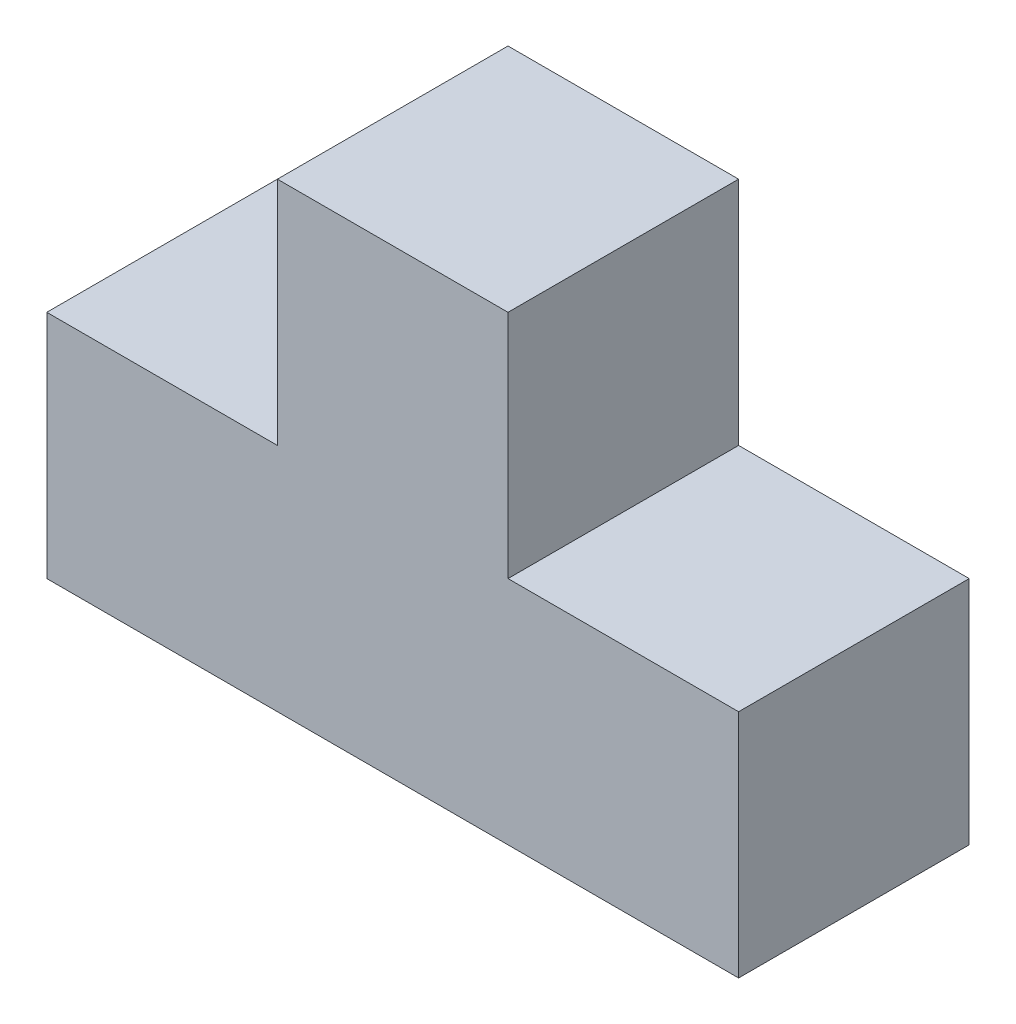
ISO-10303-21;
HEADER;
FILE_DESCRIPTION(('STEP AP214'),'2;1');
FILE_NAME('part.step','',(''),(''),'','','');
FILE_SCHEMA(('AUTOMOTIVE_DESIGN { 1 0 10303 214 1 1 1 1 }'));
ENDSEC;
DATA;
#1=APPLICATION_CONTEXT('core data for automotive mechanical design processes');
#2=APPLICATION_PROTOCOL_DEFINITION('international standard','automotive_design',2000,#1);
#3=PRODUCT_CONTEXT('',#1,'mechanical');
#4=PRODUCT('Part','Part','',(#3));
#5=PRODUCT_RELATED_PRODUCT_CATEGORY('part','',(#4));
#6=PRODUCT_DEFINITION_FORMATION('','',#4);
#7=PRODUCT_DEFINITION_CONTEXT('part definition',#1,'design');
#8=PRODUCT_DEFINITION('design','',#6,#7);
#9=PRODUCT_DEFINITION_SHAPE('','',#8);
#10=(LENGTH_UNIT() NAMED_UNIT(*) SI_UNIT(.MILLI.,.METRE.));
#11=(NAMED_UNIT(*) PLANE_ANGLE_UNIT() SI_UNIT($,.RADIAN.));
#12=(NAMED_UNIT(*) SI_UNIT($,.STERADIAN.) SOLID_ANGLE_UNIT());
#13=UNCERTAINTY_MEASURE_WITH_UNIT(LENGTH_MEASURE(1.E-05),#10,'distance_accuracy_value','');
#14=(GEOMETRIC_REPRESENTATION_CONTEXT(3) GLOBAL_UNCERTAINTY_ASSIGNED_CONTEXT((#13)) GLOBAL_UNIT_ASSIGNED_CONTEXT((#10,
#11,#12)) REPRESENTATION_CONTEXT('',''));
#15=CARTESIAN_POINT('',(0.,0.,0.));
#16=DIRECTION('',(0.,0.,1.));
#17=DIRECTION('',(1.,0.,0.));
#18=AXIS2_PLACEMENT_3D('',#15,#16,#17);
#19=CARTESIAN_POINT('',(-50.7256947830327,17.8332520721599,10.));
#20=DIRECTION('',(0.,-1.,0.));
#21=DIRECTION('',(0.,0.,-1.));
#22=AXIS2_PLACEMENT_3D('',#19,#20,#21);
#23=PLANE('',#22);
#24=DIRECTION('',(-1.,0.,0.));
#25=VECTOR('',#24,1.);
#26=CARTESIAN_POINT('',(-50.7256947830327,17.8332520721599,0.));
#27=LINE('',#26,#25);
#28=CARTESIAN_POINT('',(-40.7256947830327,17.8332520721599,0.));
#29=VERTEX_POINT('',#28);
#30=CARTESIAN_POINT('',(-50.7256947830327,17.8332520721599,0.));
#31=VERTEX_POINT('',#30);
#32=EDGE_CURVE('E144',#29,#31,#27,.T.);
#33=ORIENTED_EDGE('',*,*,#32,.T.);
#34=DIRECTION('',(0.,0.,-1.));
#35=VECTOR('',#34,1.);
#36=CARTESIAN_POINT('',(-50.7256947830327,17.8332520721599,10.));
#37=LINE('',#36,#35);
#38=CARTESIAN_POINT('',(-50.7256947830327,17.8332520721599,10.));
#39=VERTEX_POINT('',#38);
#40=EDGE_CURVE('E11',#39,#31,#37,.T.);
#41=ORIENTED_EDGE('',*,*,#40,.F.);
#42=DIRECTION('',(-1.,0.,0.));
#43=VECTOR('',#42,1.);
#44=CARTESIAN_POINT('',(-50.7256947830327,17.8332520721599,10.));
#45=LINE('',#44,#43);
#46=CARTESIAN_POINT('',(-40.7256947830327,17.8332520721599,10.));
#47=VERTEX_POINT('',#46);
#48=EDGE_CURVE('E167',#47,#39,#45,.T.);
#49=ORIENTED_EDGE('',*,*,#48,.F.);
#50=DIRECTION('',(0.,0.,-1.));
#51=VECTOR('',#50,1.);
#52=CARTESIAN_POINT('',(-40.7256947830327,17.8332520721599,10.));
#53=LINE('',#52,#51);
#54=EDGE_CURVE('E140',#47,#29,#53,.T.);
#55=ORIENTED_EDGE('',*,*,#54,.T.);
#56=EDGE_LOOP('',(#33,#41,#49,#55));
#57=FACE_BOUND('',#56,.T.);
#58=ADVANCED_FACE('F43',(#57),#23,.F.);
#59=CARTESIAN_POINT('',(-50.7256947830327,17.8332520721599,10.));
#60=DIRECTION('',(1.,0.,0.));
#61=DIRECTION('',(0.,0.,-1.));
#62=AXIS2_PLACEMENT_3D('',#59,#60,#61);
#63=PLANE('',#62);
#64=DIRECTION('',(0.,-1.,0.));
#65=VECTOR('',#64,1.);
#66=CARTESIAN_POINT('',(-50.7256947830327,17.8332520721599,0.));
#67=LINE('',#66,#65);
#68=CARTESIAN_POINT('',(-50.7256947830327,7.83325207215992,0.));
#69=VERTEX_POINT('',#68);
#70=EDGE_CURVE('E148',#31,#69,#67,.T.);
#71=ORIENTED_EDGE('',*,*,#70,.T.);
#72=DIRECTION('',(0.,0.,-1.));
#73=VECTOR('',#72,1.);
#74=CARTESIAN_POINT('',(-50.7256947830327,7.83325207215992,10.));
#75=LINE('',#74,#73);
#76=CARTESIAN_POINT('',(-50.7256947830327,7.83325207215992,10.));
#77=VERTEX_POINT('',#76);
#78=EDGE_CURVE('E52',#77,#69,#75,.T.);
#79=ORIENTED_EDGE('',*,*,#78,.F.);
#80=DIRECTION('',(0.,-1.,0.));
#81=VECTOR('',#80,1.);
#82=CARTESIAN_POINT('',(-50.7256947830327,17.8332520721599,10.));
#83=LINE('',#82,#81);
#84=EDGE_CURVE('E103',#39,#77,#83,.T.);
#85=ORIENTED_EDGE('',*,*,#84,.F.);
#86=ORIENTED_EDGE('',*,*,#40,.T.);
#87=EDGE_LOOP('',(#71,#79,#85,#86));
#88=FACE_BOUND('',#87,.T.);
#89=ADVANCED_FACE('F188',(#88),#63,.F.);
#90=CARTESIAN_POINT('',(-20.7256947830327,7.83325207215992,10.));
#91=DIRECTION('',(0.,1.,0.));
#92=DIRECTION('',(-1.,0.,0.));
#93=AXIS2_PLACEMENT_3D('',#90,#91,#92);
#94=PLANE('',#93);
#95=DIRECTION('',(1.,0.,0.));
#96=VECTOR('',#95,1.);
#97=CARTESIAN_POINT('',(-20.7256947830327,7.83325207215992,0.));
#98=LINE('',#97,#96);
#99=CARTESIAN_POINT('',(-20.7256947830327,7.83325207215992,0.));
#100=VERTEX_POINT('',#99);
#101=EDGE_CURVE('E152',#69,#100,#98,.T.);
#102=ORIENTED_EDGE('',*,*,#101,.T.);
#103=DIRECTION('',(0.,0.,-1.));
#104=VECTOR('',#103,1.);
#105=CARTESIAN_POINT('',(-20.7256947830327,7.83325207215992,10.));
#106=LINE('',#105,#104);
#107=CARTESIAN_POINT('',(-20.7256947830327,7.83325207215992,10.));
#108=VERTEX_POINT('',#107);
#109=EDGE_CURVE('E178',#108,#100,#106,.T.);
#110=ORIENTED_EDGE('',*,*,#109,.F.);
#111=DIRECTION('',(1.,0.,0.));
#112=VECTOR('',#111,1.);
#113=CARTESIAN_POINT('',(-50.7256947830327,7.83325207215992,10.));
#114=LINE('',#113,#112);
#115=EDGE_CURVE('E187',#77,#108,#114,.T.);
#116=ORIENTED_EDGE('',*,*,#115,.F.);
#117=ORIENTED_EDGE('',*,*,#78,.T.);
#118=EDGE_LOOP('',(#102,#110,#116,#117));
#119=FACE_BOUND('',#118,.T.);
#120=ADVANCED_FACE('F185',(#119),#94,.F.);
#121=CARTESIAN_POINT('',(-20.7256947830327,17.8332520721599,10.));
#122=DIRECTION('',(-1.,0.,0.));
#123=DIRECTION('',(0.,0.,1.));
#124=AXIS2_PLACEMENT_3D('',#121,#122,#123);
#125=PLANE('',#124);
#126=DIRECTION('',(0.,1.,0.));
#127=VECTOR('',#126,1.);
#128=CARTESIAN_POINT('',(-20.7256947830327,17.8332520721599,0.));
#129=LINE('',#128,#127);
#130=CARTESIAN_POINT('',(-20.7256947830327,17.8332520721599,0.));
#131=VERTEX_POINT('',#130);
#132=EDGE_CURVE('E155',#100,#131,#129,.T.);
#133=ORIENTED_EDGE('',*,*,#132,.T.);
#134=DIRECTION('',(0.,0.,-1.));
#135=VECTOR('',#134,1.);
#136=CARTESIAN_POINT('',(-20.7256947830327,17.8332520721599,10.));
#137=LINE('',#136,#135);
#138=CARTESIAN_POINT('',(-20.7256947830327,17.8332520721599,10.));
#139=VERTEX_POINT('',#138);
#140=EDGE_CURVE('E174',#139,#131,#137,.T.);
#141=ORIENTED_EDGE('',*,*,#140,.F.);
#142=DIRECTION('',(0.,1.,0.));
#143=VECTOR('',#142,1.);
#144=CARTESIAN_POINT('',(-20.7256947830327,17.8332520721599,10.));
#145=LINE('',#144,#143);
#146=EDGE_CURVE('E202',#108,#139,#145,.T.);
#147=ORIENTED_EDGE('',*,*,#146,.F.);
#148=ORIENTED_EDGE('',*,*,#109,.T.);
#149=EDGE_LOOP('',(#133,#141,#147,#148));
#150=FACE_BOUND('',#149,.T.);
#151=ADVANCED_FACE('F197',(#150),#125,.F.);
#152=CARTESIAN_POINT('',(-30.7256947830327,17.8332520721599,10.));
#153=DIRECTION('',(0.,-1.,0.));
#154=DIRECTION('',(0.,0.,-1.));
#155=AXIS2_PLACEMENT_3D('',#152,#153,#154);
#156=PLANE('',#155);
#157=DIRECTION('',(-1.,0.,0.));
#158=VECTOR('',#157,1.);
#159=CARTESIAN_POINT('',(-30.7256947830327,17.8332520721599,0.));
#160=LINE('',#159,#158);
#161=CARTESIAN_POINT('',(-30.7256947830327,17.8332520721599,0.));
#162=VERTEX_POINT('',#161);
#163=EDGE_CURVE('E158',#131,#162,#160,.T.);
#164=ORIENTED_EDGE('',*,*,#163,.T.);
#165=DIRECTION('',(0.,0.,-1.));
#166=VECTOR('',#165,1.);
#167=CARTESIAN_POINT('',(-30.7256947830327,17.8332520721599,10.));
#168=LINE('',#167,#166);
#169=CARTESIAN_POINT('',(-30.7256947830327,17.8332520721599,10.));
#170=VERTEX_POINT('',#169);
#171=EDGE_CURVE('E133',#170,#162,#168,.T.);
#172=ORIENTED_EDGE('',*,*,#171,.F.);
#173=DIRECTION('',(-1.,0.,0.));
#174=VECTOR('',#173,1.);
#175=CARTESIAN_POINT('',(-30.7256947830327,17.8332520721599,10.));
#176=LINE('',#175,#174);
#177=EDGE_CURVE('E122',#139,#170,#176,.T.);
#178=ORIENTED_EDGE('',*,*,#177,.F.);
#179=ORIENTED_EDGE('',*,*,#140,.T.);
#180=EDGE_LOOP('',(#164,#172,#178,#179));
#181=FACE_BOUND('',#180,.T.);
#182=ADVANCED_FACE('F200',(#181),#156,.F.);
#183=CARTESIAN_POINT('',(-30.7256947830327,27.8332520721599,10.));
#184=DIRECTION('',(-1.,0.,0.));
#185=DIRECTION('',(0.,0.,1.));
#186=AXIS2_PLACEMENT_3D('',#183,#184,#185);
#187=PLANE('',#186);
#188=DIRECTION('',(0.,1.,0.));
#189=VECTOR('',#188,1.);
#190=CARTESIAN_POINT('',(-30.7256947830327,27.8332520721599,0.));
#191=LINE('',#190,#189);
#192=CARTESIAN_POINT('',(-30.7256947830327,27.8332520721599,0.));
#193=VERTEX_POINT('',#192);
#194=EDGE_CURVE('E131',#162,#193,#191,.T.);
#195=ORIENTED_EDGE('',*,*,#194,.T.);
#196=DIRECTION('',(0.,0.,-1.));
#197=VECTOR('',#196,1.);
#198=CARTESIAN_POINT('',(-30.7256947830327,27.8332520721599,10.));
#199=LINE('',#198,#197);
#200=CARTESIAN_POINT('',(-30.7256947830327,27.8332520721599,10.));
#201=VERTEX_POINT('',#200);
#202=EDGE_CURVE('E128',#201,#193,#199,.T.);
#203=ORIENTED_EDGE('',*,*,#202,.F.);
#204=DIRECTION('',(0.,1.,0.));
#205=VECTOR('',#204,1.);
#206=CARTESIAN_POINT('',(-30.7256947830327,27.8332520721599,10.));
#207=LINE('',#206,#205);
#208=EDGE_CURVE('E116',#170,#201,#207,.T.);
#209=ORIENTED_EDGE('',*,*,#208,.F.);
#210=ORIENTED_EDGE('',*,*,#171,.T.);
#211=EDGE_LOOP('',(#195,#203,#209,#210));
#212=FACE_BOUND('',#211,.T.);
#213=ADVANCED_FACE('F129',(#212),#187,.F.);
#214=CARTESIAN_POINT('',(-40.7256947830327,27.8332520721599,10.));
#215=DIRECTION('',(0.,-1.,0.));
#216=DIRECTION('',(0.,0.,-1.));
#217=AXIS2_PLACEMENT_3D('',#214,#215,#216);
#218=PLANE('',#217);
#219=DIRECTION('',(-1.,0.,0.));
#220=VECTOR('',#219,1.);
#221=CARTESIAN_POINT('',(-40.7256947830327,27.8332520721599,0.));
#222=LINE('',#221,#220);
#223=CARTESIAN_POINT('',(-40.7256947830327,27.8332520721599,0.));
#224=VERTEX_POINT('',#223);
#225=EDGE_CURVE('E89',#193,#224,#222,.T.);
#226=ORIENTED_EDGE('',*,*,#225,.T.);
#227=DIRECTION('',(0.,0.,-1.));
#228=VECTOR('',#227,1.);
#229=CARTESIAN_POINT('',(-40.7256947830327,27.8332520721599,10.));
#230=LINE('',#229,#228);
#231=CARTESIAN_POINT('',(-40.7256947830327,27.8332520721599,10.));
#232=VERTEX_POINT('',#231);
#233=EDGE_CURVE('E134',#232,#224,#230,.T.);
#234=ORIENTED_EDGE('',*,*,#233,.F.);
#235=DIRECTION('',(-1.,0.,0.));
#236=VECTOR('',#235,1.);
#237=CARTESIAN_POINT('',(-40.7256947830327,27.8332520721599,10.));
#238=LINE('',#237,#236);
#239=EDGE_CURVE('E120',#201,#232,#238,.T.);
#240=ORIENTED_EDGE('',*,*,#239,.F.);
#241=ORIENTED_EDGE('',*,*,#202,.T.);
#242=EDGE_LOOP('',(#226,#234,#240,#241));
#243=FACE_BOUND('',#242,.T.);
#244=ADVANCED_FACE('F136',(#243),#218,.F.);
#245=CARTESIAN_POINT('',(-40.7256947830327,17.8332520721599,10.));
#246=DIRECTION('',(1.,0.,0.));
#247=DIRECTION('',(0.,0.,-1.));
#248=AXIS2_PLACEMENT_3D('',#245,#246,#247);
#249=PLANE('',#248);
#250=DIRECTION('',(0.,-1.,0.));
#251=VECTOR('',#250,1.);
#252=CARTESIAN_POINT('',(-40.7256947830327,17.8332520721599,0.));
#253=LINE('',#252,#251);
#254=EDGE_CURVE('E95',#224,#29,#253,.T.);
#255=ORIENTED_EDGE('',*,*,#254,.T.);
#256=ORIENTED_EDGE('',*,*,#54,.F.);
#257=DIRECTION('',(0.,-1.,0.));
#258=VECTOR('',#257,1.);
#259=CARTESIAN_POINT('',(-40.7256947830327,17.8332520721599,10.));
#260=LINE('',#259,#258);
#261=EDGE_CURVE('E60',#232,#47,#260,.T.);
#262=ORIENTED_EDGE('',*,*,#261,.F.);
#263=ORIENTED_EDGE('',*,*,#233,.T.);
#264=EDGE_LOOP('',(#255,#256,#262,#263));
#265=FACE_BOUND('',#264,.T.);
#266=ADVANCED_FACE('F213',(#265),#249,.F.);
#267=CARTESIAN_POINT('',(0.,0.,10.));
#268=DIRECTION('',(0.,0.,1.));
#269=DIRECTION('',(1.,0.,0.));
#270=AXIS2_PLACEMENT_3D('',#267,#268,#269);
#271=PLANE('',#270);
#272=ORIENTED_EDGE('',*,*,#48,.T.);
#273=ORIENTED_EDGE('',*,*,#84,.T.);
#274=ORIENTED_EDGE('',*,*,#115,.T.);
#275=ORIENTED_EDGE('',*,*,#146,.T.);
#276=ORIENTED_EDGE('',*,*,#177,.T.);
#277=ORIENTED_EDGE('',*,*,#208,.T.);
#278=ORIENTED_EDGE('',*,*,#239,.T.);
#279=ORIENTED_EDGE('',*,*,#261,.T.);
#280=EDGE_LOOP('',(#272,#273,#274,#275,#276,#277,#278,#279));
#281=FACE_BOUND('',#280,.T.);
#282=ADVANCED_FACE('F118',(#281),#271,.T.);
#283=CARTESIAN_POINT('',(0.,0.,0.));
#284=DIRECTION('',(0.,0.,1.));
#285=DIRECTION('',(1.,0.,0.));
#286=AXIS2_PLACEMENT_3D('',#283,#284,#285);
#287=PLANE('',#286);
#288=ORIENTED_EDGE('',*,*,#32,.F.);
#289=ORIENTED_EDGE('',*,*,#254,.F.);
#290=ORIENTED_EDGE('',*,*,#225,.F.);
#291=ORIENTED_EDGE('',*,*,#194,.F.);
#292=ORIENTED_EDGE('',*,*,#163,.F.);
#293=ORIENTED_EDGE('',*,*,#132,.F.);
#294=ORIENTED_EDGE('',*,*,#101,.F.);
#295=ORIENTED_EDGE('',*,*,#70,.F.);
#296=EDGE_LOOP('',(#288,#289,#290,#291,#292,#293,#294,#295));
#297=FACE_BOUND('',#296,.T.);
#298=ADVANCED_FACE('F192',(#297),#287,.F.);
#299=CLOSED_SHELL('',(#58,#89,#120,#151,#182,#213,#244,#266,#282,#298));
#300=MANIFOLD_SOLID_BREP('B2',#299);
#301=ADVANCED_BREP_SHAPE_REPRESENTATION('',(#18,#300),#14);
#302=SHAPE_DEFINITION_REPRESENTATION(#9,#301);
ENDSEC;
END-ISO-10303-21;
